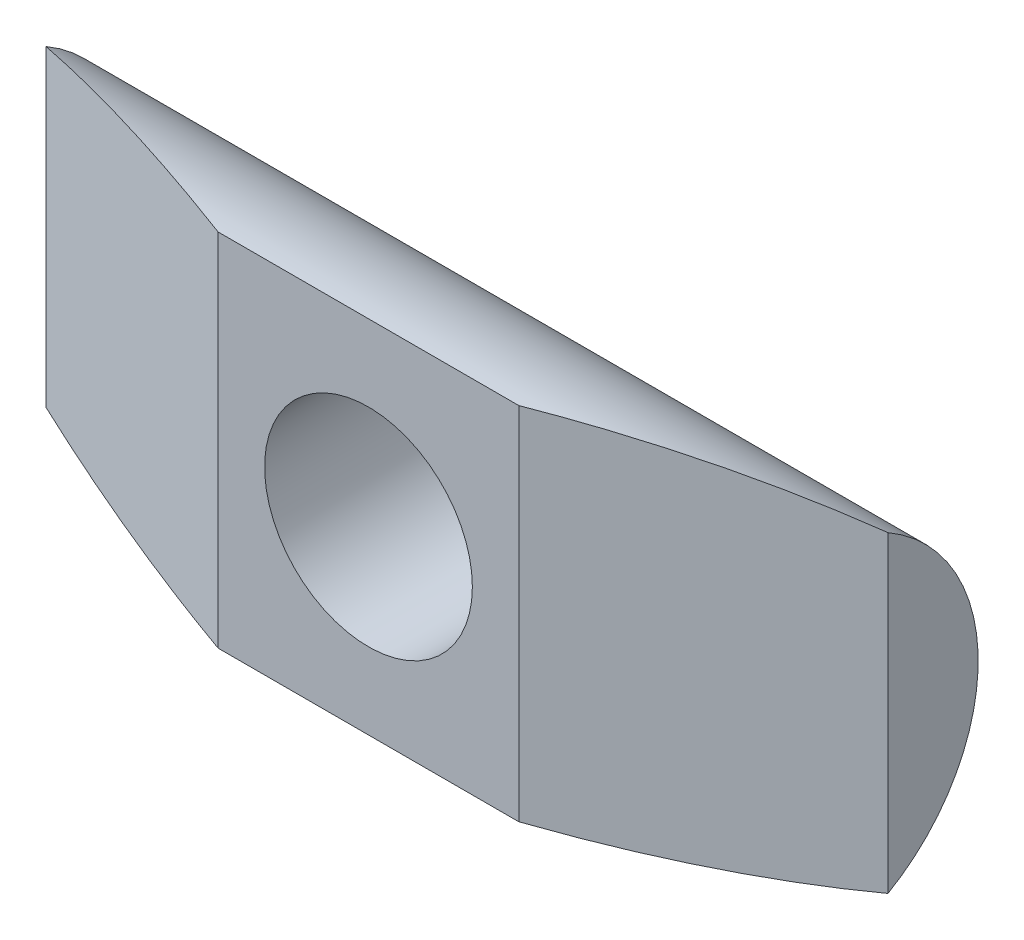
ISO-10303-21;
HEADER;
FILE_DESCRIPTION(('STEP AP214'),'2;1');
FILE_NAME('part.step','',(''),(''),'','','');
FILE_SCHEMA(('AUTOMOTIVE_DESIGN { 1 0 10303 214 1 1 1 1 }'));
ENDSEC;
DATA;
#1=APPLICATION_CONTEXT('core data for automotive mechanical design processes');
#2=APPLICATION_PROTOCOL_DEFINITION('international standard','automotive_design',2000,#1);
#3=PRODUCT_CONTEXT('',#1,'mechanical');
#4=PRODUCT('Part','Part','',(#3));
#5=PRODUCT_RELATED_PRODUCT_CATEGORY('part','',(#4));
#6=PRODUCT_DEFINITION_FORMATION('','',#4);
#7=PRODUCT_DEFINITION_CONTEXT('part definition',#1,'design');
#8=PRODUCT_DEFINITION('design','',#6,#7);
#9=PRODUCT_DEFINITION_SHAPE('','',#8);
#10=(LENGTH_UNIT() NAMED_UNIT(*) SI_UNIT(.MILLI.,.METRE.));
#11=(NAMED_UNIT(*) PLANE_ANGLE_UNIT() SI_UNIT($,.RADIAN.));
#12=(NAMED_UNIT(*) SI_UNIT($,.STERADIAN.) SOLID_ANGLE_UNIT());
#13=UNCERTAINTY_MEASURE_WITH_UNIT(LENGTH_MEASURE(1.E-05),#10,'distance_accuracy_value','');
#14=(GEOMETRIC_REPRESENTATION_CONTEXT(3) GLOBAL_UNCERTAINTY_ASSIGNED_CONTEXT((#13)) GLOBAL_UNIT_ASSIGNED_CONTEXT((#10,
#11,#12)) REPRESENTATION_CONTEXT('',''));
#15=CARTESIAN_POINT('',(0.,0.,0.));
#16=DIRECTION('',(0.,0.,1.));
#17=DIRECTION('',(1.,0.,0.));
#18=AXIS2_PLACEMENT_3D('',#15,#16,#17);
#19=CARTESIAN_POINT('',(-14.,0.,0.));
#20=DIRECTION('',(1.,0.,0.));
#21=DIRECTION('',(0.,0.,-1.));
#22=AXIS2_PLACEMENT_3D('',#19,#20,#21);
#23=CYLINDRICAL_SURFACE('',#22,6.);
#24=CARTESIAN_POINT('',(3.4544,0.,-6.));
#25=CARTESIAN_POINT('',(3.45439921898934,-0.0890025247768635,-5.99999928987297));
#26=CARTESIAN_POINT('',(3.45095478193103,-0.178029493212493,-5.998014397073));
#27=CARTESIAN_POINT('',(3.43722011436506,-0.355415955447675,-5.99012290458809));
#28=CARTESIAN_POINT('',(3.42692579023553,-0.443775018140048,-5.98421395981977));
#29=CARTESIAN_POINT('',(3.39959760043751,-0.619284647285888,-5.96860596572888));
#30=CARTESIAN_POINT('',(3.38255088748408,-0.70643258032686,-5.95889969193811));
#31=CARTESIAN_POINT('',(3.3419395504222,-0.878731702228658,-5.93594180401801));
#32=CARTESIAN_POINT('',(3.31837215082102,-0.963882024038264,-5.92268868027124));
#33=CARTESIAN_POINT('',(3.23855299598419,-1.21459488407285,-5.87821096315222));
#34=CARTESIAN_POINT('',(3.17301834607299,-1.3764599534809,-5.84216992524478));
#35=CARTESIAN_POINT('',(3.01976785833436,-1.6863682211323,-5.76037649899437));
#36=CARTESIAN_POINT('',(2.93205762380787,-1.8344148980717,-5.7146265643525));
#37=CARTESIAN_POINT('',(2.72976687812328,-2.12480394568095,-5.61342266116156));
#38=CARTESIAN_POINT('',(2.61369379881022,-2.26594397625408,-5.55750443409247));
#39=CARTESIAN_POINT('',(2.36128363756551,-2.52791846070738,-5.44335385435898));
#40=CARTESIAN_POINT('',(2.22492255770303,-2.6487285013681,-5.38511882181833));
#41=CARTESIAN_POINT('',(1.91795529474811,-2.88014922887508,-5.26531274081294));
#42=CARTESIAN_POINT('',(1.74522910671619,-2.98814940131263,-5.20408628966167));
#43=CARTESIAN_POINT('',(1.38050047664221,-3.17312745020671,-5.09342153215339));
#44=CARTESIAN_POINT('',(1.18852810920303,-3.25015281315714,-5.04396522924281));
#45=CARTESIAN_POINT('',(0.834815880396335,-3.35588729956328,-4.97404268116328));
#46=CARTESIAN_POINT('',(0.675952302025197,-3.39155837727163,-4.94956223304145));
#47=CARTESIAN_POINT('',(0.35325825412214,-3.440150282253,-4.91592086234216));
#48=CARTESIAN_POINT('',(0.189433431781938,-3.45309605490536,-4.90674314264228));
#49=CARTESIAN_POINT('',(-0.138712032594599,-3.45551776037083,-4.90503830395962));
#50=CARTESIAN_POINT('',(-0.303033049020929,-3.44495975133199,-4.91253526489832));
#51=CARTESIAN_POINT('',(-0.627121621278127,-3.40093900483978,-4.94310627559886));
#52=CARTESIAN_POINT('',(-0.786885917851981,-3.36746028080084,-4.96619119739217));
#53=CARTESIAN_POINT('',(-1.09712012878664,-3.27949684491801,-5.0247027285861));
#54=CARTESIAN_POINT('',(-1.2476331675814,-3.22511979627003,-5.06006599415033));
#55=CARTESIAN_POINT('',(-1.53785648665194,-3.09726621315077,-5.13931806397932));
#56=CARTESIAN_POINT('',(-1.67756263191518,-3.02378241435952,-5.18321010924923));
#57=CARTESIAN_POINT('',(-1.96631504361599,-2.84599776728001,-5.28320789487936));
#58=CARTESIAN_POINT('',(-2.11319054796475,-2.73862969226059,-5.34013936955619));
#59=CARTESIAN_POINT('',(-2.38824837719828,-2.502416496376,-5.45483330168754));
#60=CARTESIAN_POINT('',(-2.51641427462678,-2.37355271195356,-5.51259644106085));
#61=CARTESIAN_POINT('',(-2.76565722298808,-2.07972369661752,-5.63050054560709));
#62=CARTESIAN_POINT('',(-2.88413260924484,-1.91229579108908,-5.69012364322553));
#63=CARTESIAN_POINT('',(-3.03904449158945,-1.64551015958455,-5.77070137391051));
#64=CARTESIAN_POINT('',(-3.08689617988591,-1.55393450003539,-5.79609285904931));
#65=CARTESIAN_POINT('',(-3.1744859378761,-1.36610170509735,-5.8432107538657));
#66=CARTESIAN_POINT('',(-3.21422893281565,-1.26984745576158,-5.86493938696881));
#67=CARTESIAN_POINT('',(-3.28266329014318,-1.08003732865997,-5.90273186874885));
#68=CARTESIAN_POINT('',(-3.31192192607287,-0.986742185034364,-5.91908022599022));
#69=CARTESIAN_POINT('',(-3.36252228604426,-0.797441635699795,-5.94754052727591));
#70=CARTESIAN_POINT('',(-3.383868300688,-0.70143772929441,-5.9596547670573));
#71=CARTESIAN_POINT('',(-3.41832629049983,-0.507556147381272,-5.97928713892707));
#72=CARTESIAN_POINT('',(-3.43144314775871,-0.4096796184277,-5.98680799604934));
#73=CARTESIAN_POINT('',(-3.44924646261929,-0.212918105626553,-5.9970299565629));
#74=CARTESIAN_POINT('',(-3.45393389730074,-0.11403323999478,-5.99973161856132));
#75=CARTESIAN_POINT('',(-3.4547462520113,0.071533433504897,-6.00019937573239));
#76=CARTESIAN_POINT('',(-3.45185922042307,0.158210674539508,-5.99853500118922));
#77=CARTESIAN_POINT('',(-3.43960125393638,0.330962075486235,-5.99149043803351));
#78=CARTESIAN_POINT('',(-3.43022819348286,0.417036028349668,-5.98610903130277));
#79=CARTESIAN_POINT('',(-3.39252729125364,0.673323120597361,-5.96455311308873));
#80=CARTESIAN_POINT('',(-3.35461822597177,0.84179221927222,-5.94296699474927));
#81=CARTESIAN_POINT('',(-3.25564035906786,1.16718795601752,-5.88767121008537));
#82=CARTESIAN_POINT('',(-3.19485944907171,1.324230244709,-5.85411250659272));
#83=CARTESIAN_POINT('',(-3.05235401232043,1.6259971043955,-5.77757518673973));
#84=CARTESIAN_POINT('',(-2.97062459084375,1.77071878607877,-5.73459436919681));
#85=CARTESIAN_POINT('',(-2.77895959015346,2.05995970251254,-5.63757038835305));
#86=CARTESIAN_POINT('',(-2.66697210122832,2.20288591736509,-5.58284115804983));
#87=CARTESIAN_POINT('',(-2.42269640159962,2.46902932850767,-5.47035783853533));
#88=CARTESIAN_POINT('',(-2.29038479602086,2.5922234732863,-5.41260031460445));
#89=CARTESIAN_POINT('',(-1.99140539371982,2.82978906614515,-5.29263123108389));
#90=CARTESIAN_POINT('',(-1.82253871382815,2.94153760009073,-5.23066633381948));
#91=CARTESIAN_POINT('',(-1.46517905689068,3.13484533772696,-5.11716292030284));
#92=CARTESIAN_POINT('',(-1.27671195867649,3.21644371679014,-5.0656109139292));
#93=CARTESIAN_POINT('',(-0.926528642954367,3.33177773577451,-4.9902857451768));
#94=CARTESIAN_POINT('',(-0.767731928803084,3.37202227147148,-4.96292739598951));
#95=CARTESIAN_POINT('',(-0.444274053143748,3.42963628312249,-4.92329740475631));
#96=CARTESIAN_POINT('',(-0.279620023311164,3.44703266099302,-4.91100802131798));
#97=CARTESIAN_POINT('',(0.0512610299865741,3.45799230164151,-4.90329940784792));
#98=CARTESIAN_POINT('',(0.217490752097159,3.45150205350862,-4.90791805512812));
#99=CARTESIAN_POINT('',(0.546100458630568,3.41497054476564,-4.93340065829837));
#100=CARTESIAN_POINT('',(0.708477964463519,3.38491452338617,-4.95427479599876));
#101=CARTESIAN_POINT('',(1.02167834727667,3.30373911074967,-5.00875263378437));
#102=CARTESIAN_POINT('',(1.1726747289011,3.25308715633281,-5.04207258410152));
#103=CARTESIAN_POINT('',(1.46435430344148,3.13264657945839,-5.11777016410095));
#104=CARTESIAN_POINT('',(1.60503372255556,3.06285099834095,-5.16015108618588));
#105=CARTESIAN_POINT('',(1.89525486820885,2.89366460020851,-5.2571475396122));
#106=CARTESIAN_POINT('',(2.04280868081729,2.79136756896818,-5.31264169755519));
#107=CARTESIAN_POINT('',(2.32008862610775,2.56555735023689,-5.42529830404962));
#108=CARTESIAN_POINT('',(2.44979869054688,2.44202526288426,-5.48246220077244));
#109=CARTESIAN_POINT('',(2.7048577224615,2.15814561004922,-5.6008032286322));
#110=CARTESIAN_POINT('',(2.82743929347895,1.99509870111402,-5.66153362970224));
#111=CARTESIAN_POINT('',(3.04320321969928,1.64730078192699,-5.77231638159746));
#112=CARTESIAN_POINT('',(3.13640213687392,1.46256207946903,-5.8223747427065));
#113=CARTESIAN_POINT('',(3.27547485242939,1.1105182463965,-5.89856868878244));
#114=CARTESIAN_POINT('',(3.32682279952143,0.945974132980587,-5.92737785517799));
#115=CARTESIAN_POINT('',(3.38510261957639,0.693839701723605,-5.96035248934734));
#116=CARTESIAN_POINT('',(3.40139975194672,0.608981353510738,-5.96963403641377));
#117=CARTESIAN_POINT('',(3.42761015042143,0.437986272713973,-5.98460616581198));
#118=CARTESIAN_POINT('',(3.43752689208844,0.3518502623122,-5.99029870313554));
#119=CARTESIAN_POINT('',(3.44758955946569,0.221285263613514,-5.99608109085097));
#120=CARTESIAN_POINT('',(3.45014215417564,0.177085018827701,-5.99754946978157));
#121=CARTESIAN_POINT('',(3.45354767287192,0.0885918749760161,-5.9995091609027));
#122=CARTESIAN_POINT('',(3.45440038873014,0.0442989652290428,-6.00000035344944));
#123=CARTESIAN_POINT('',(3.4544,0.,-6.));
#124=B_SPLINE_CURVE_WITH_KNOTS('',3,(#24,#25,#26,#27,#28,#29,#30,#31,#32,#33,#34,#35,#36,#37,
#38,#39,#40,#41,#42,#43,#44,#45,#46,#47,#48,#49,#50,#51,#52,#53,#54,#55,#56,#57,#58,#59,#60,#61,
#62,#63,#64,#65,#66,#67,#68,#69,#70,#71,#72,#73,#74,#75,#76,#77,#78,#79,#80,#81,#82,#83,#84,#85,
#86,#87,#88,#89,#90,#91,#92,#93,#94,#95,#96,#97,#98,#99,#100,#101,#102,#103,#104,#105,#106,#107,
#108,#109,#110,#111,#112,#113,#114,#115,#116,#117,#118,#119,#120,#121,#122,#123),.UNSPECIFIED.,
.T.,.F.,(4,2,2,2,2,2,2,2,2,2,2,2,2,2,2,2,2,2,2,2,2,2,2,2,2,2,2,2,2,2,2,2,2,2,2,2,2,2,2,2,2,2,2,
2,2,2,2,2,2,4),(0.,0.266961307336892,0.534082299252971,0.801713983246575,1.06945975883829,
1.60181686219707,2.13403958438384,2.70505579276962,3.27675288570658,3.91175201744222,
4.54577390659703,5.03759364620741,5.5288731809774,6.02086263353241,6.51319558562288,
7.00302543793377,7.49304179485808,8.06267787950159,8.63281114740295,9.26992334820901,
9.58873496048437,9.90735234527295,10.2043300197065,10.5011464222402,10.7977865663455,
11.0943923237814,11.3542842688428,11.6142614241967,12.1336511334778,12.6467107481056,
13.1598903510606,13.7265532230052,14.2938733313732,14.9261149619433,15.557532181044,
16.0536722061697,16.5492275400179,17.0458936938584,17.54287119063,18.0291485331307,
18.5156028710088,19.0772015767001,19.6393027355213,20.2746002449324,20.9095390165134,
21.4313152017037,21.6917700671883,21.9520829358318,22.0849405374945,22.2178144048467),.UNSPECIFIED.);
#125=CARTESIAN_POINT('',(3.4544,0.,-6.));
#126=VERTEX_POINT('',#125);
#127=EDGE_CURVE('E11',#126,#126,#124,.T.);
#128=ORIENTED_EDGE('',*,*,#127,.F.);
#129=EDGE_LOOP('',(#128));
#130=FACE_BOUND('',#129,.T.);
#131=DIRECTION('',(1.,0.,0.));
#132=VECTOR('',#131,1.);
#133=CARTESIAN_POINT('',(-14.,-5.99366096842319,0.275732108395758));
#134=LINE('',#133,#132);
#135=CARTESIAN_POINT('',(5.,-5.99366096842319,0.275732108395758));
#136=VERTEX_POINT('',#135);
#137=CARTESIAN_POINT('',(-5.,-5.99366096842319,0.275732108395758));
#138=VERTEX_POINT('',#137);
#139=EDGE_CURVE('E49',#136,#138,#134,.F.);
#140=ORIENTED_EDGE('',*,*,#139,.T.);
#141=CARTESIAN_POINT('',(-5.75756774163597,0.,0.));
#142=DIRECTION('',(-0.342020143325663,0.,0.93969262078591));
#143=DIRECTION('',(0.939692620785911,0.,0.342020143325663));
#144=AXIS2_PLACEMENT_3D('',#141,#142,#143);
#145=ELLIPSE('',#144,17.5428264009788,6.);
#146=CARTESIAN_POINT('',(-14.,-5.19615242270666,-3.));
#147=VERTEX_POINT('',#146);
#148=EDGE_CURVE('E64',#138,#147,#145,.F.);
#149=ORIENTED_EDGE('',*,*,#148,.T.);
#150=CARTESIAN_POINT('',(-14.,0.,0.));
#151=DIRECTION('',(1.,0.,0.));
#152=DIRECTION('',(0.,0.,-1.));
#153=AXIS2_PLACEMENT_3D('',#150,#151,#152);
#154=CIRCLE('',#153,6.);
#155=CARTESIAN_POINT('',(-14.,5.19615242270666,-3.));
#156=VERTEX_POINT('',#155);
#157=EDGE_CURVE('E90',#147,#156,#154,.T.);
#158=ORIENTED_EDGE('',*,*,#157,.T.);
#159=CARTESIAN_POINT('',(-5.,5.99366096842319,0.275732108395758));
#160=VERTEX_POINT('',#159);
#161=EDGE_CURVE('E104',#156,#160,#145,.F.);
#162=ORIENTED_EDGE('',*,*,#161,.T.);
#163=DIRECTION('',(1.,0.,0.));
#164=VECTOR('',#163,1.);
#165=CARTESIAN_POINT('',(-14.,5.99366096842319,0.275732108395758));
#166=LINE('',#165,#164);
#167=CARTESIAN_POINT('',(5.,5.99366096842319,0.275732108395758));
#168=VERTEX_POINT('',#167);
#169=EDGE_CURVE('E97',#160,#168,#166,.T.);
#170=ORIENTED_EDGE('',*,*,#169,.T.);
#171=CARTESIAN_POINT('',(5.75756774163597,0.,0.));
#172=DIRECTION('',(0.342020143325662,0.,0.939692620785911));
#173=DIRECTION('',(0.939692620785911,0.,-0.342020143325662));
#174=AXIS2_PLACEMENT_3D('',#171,#172,#173);
#175=ELLIPSE('',#174,17.5428264009789,6.);
#176=CARTESIAN_POINT('',(14.,5.19615242270666,-3.));
#177=VERTEX_POINT('',#176);
#178=EDGE_CURVE('E84',#168,#177,#175,.F.);
#179=ORIENTED_EDGE('',*,*,#178,.T.);
#180=CARTESIAN_POINT('',(14.,0.,0.));
#181=DIRECTION('',(1.,0.,0.));
#182=DIRECTION('',(0.,0.,-1.));
#183=AXIS2_PLACEMENT_3D('',#180,#181,#182);
#184=CIRCLE('',#183,6.);
#185=CARTESIAN_POINT('',(14.,-5.19615242270666,-3.));
#186=VERTEX_POINT('',#185);
#187=EDGE_CURVE('E95',#186,#177,#184,.T.);
#188=ORIENTED_EDGE('',*,*,#187,.F.);
#189=EDGE_CURVE('E56',#186,#136,#175,.F.);
#190=ORIENTED_EDGE('',*,*,#189,.T.);
#191=EDGE_LOOP('',(#140,#149,#158,#162,#170,#179,#188,#190));
#192=FACE_BOUND('',#191,.T.);
#193=ADVANCED_FACE('F37',(#130,#192),#23,.T.);
#194=CARTESIAN_POINT('',(-14.,0.,0.));
#195=DIRECTION('',(1.,0.,0.));
#196=DIRECTION('',(0.,0.,-1.));
#197=AXIS2_PLACEMENT_3D('',#194,#195,#196);
#198=PLANE('',#197);
#199=DIRECTION('',(0.,-1.,0.));
#200=VECTOR('',#199,1.);
#201=CARTESIAN_POINT('',(-14.,0.,-3.));
#202=LINE('',#201,#200);
#203=EDGE_CURVE('E89',#156,#147,#202,.T.);
#204=ORIENTED_EDGE('',*,*,#203,.F.);
#205=ORIENTED_EDGE('',*,*,#157,.F.);
#206=EDGE_LOOP('',(#204,#205));
#207=FACE_BOUND('',#206,.T.);
#208=ADVANCED_FACE('F131',(#207),#198,.F.);
#209=CARTESIAN_POINT('',(14.,0.,0.));
#210=DIRECTION('',(1.,0.,0.));
#211=DIRECTION('',(0.,0.,-1.));
#212=AXIS2_PLACEMENT_3D('',#209,#210,#211);
#213=PLANE('',#212);
#214=ORIENTED_EDGE('',*,*,#187,.T.);
#215=DIRECTION('',(0.,-1.,0.));
#216=VECTOR('',#215,1.);
#217=CARTESIAN_POINT('',(14.,0.,-3.));
#218=LINE('',#217,#216);
#219=EDGE_CURVE('E81',#177,#186,#218,.T.);
#220=ORIENTED_EDGE('',*,*,#219,.T.);
#221=EDGE_LOOP('',(#214,#220));
#222=FACE_BOUND('',#221,.T.);
#223=ADVANCED_FACE('F100',(#222),#213,.T.);
#224=CARTESIAN_POINT('',(-5.,20.,0.275732108395758));
#225=DIRECTION('',(-0.342020143325663,0.,0.93969262078591));
#226=DIRECTION('',(0.939692620785911,0.,0.342020143325663));
#227=AXIS2_PLACEMENT_3D('',#224,#225,#226);
#228=PLANE('',#227);
#229=DIRECTION('',(0.,-1.,0.));
#230=VECTOR('',#229,1.);
#231=CARTESIAN_POINT('',(-5.,20.,0.275732108395758));
#232=LINE('',#231,#230);
#233=EDGE_CURVE('E111',#160,#138,#232,.T.);
#234=ORIENTED_EDGE('',*,*,#233,.F.);
#235=ORIENTED_EDGE('',*,*,#161,.F.);
#236=ORIENTED_EDGE('',*,*,#203,.T.);
#237=ORIENTED_EDGE('',*,*,#148,.F.);
#238=EDGE_LOOP('',(#234,#235,#236,#237));
#239=FACE_BOUND('',#238,.T.);
#240=ADVANCED_FACE('F128',(#239),#228,.T.);
#241=CARTESIAN_POINT('',(5.,20.,0.275732108395758));
#242=DIRECTION('',(0.342020143325662,0.,0.939692620785911));
#243=DIRECTION('',(0.939692620785911,0.,-0.342020143325662));
#244=AXIS2_PLACEMENT_3D('',#241,#242,#243);
#245=PLANE('',#244);
#246=ORIENTED_EDGE('',*,*,#219,.F.);
#247=ORIENTED_EDGE('',*,*,#178,.F.);
#248=DIRECTION('',(0.,-1.,0.));
#249=VECTOR('',#248,1.);
#250=CARTESIAN_POINT('',(5.,20.,0.275732108395758));
#251=LINE('',#250,#249);
#252=EDGE_CURVE('E98',#168,#136,#251,.T.);
#253=ORIENTED_EDGE('',*,*,#252,.T.);
#254=ORIENTED_EDGE('',*,*,#189,.F.);
#255=EDGE_LOOP('',(#246,#247,#253,#254));
#256=FACE_BOUND('',#255,.T.);
#257=ADVANCED_FACE('F83',(#256),#245,.T.);
#258=CARTESIAN_POINT('',(-5.,20.,0.275732108395758));
#259=DIRECTION('',(0.,0.,1.));
#260=DIRECTION('',(1.,0.,0.));
#261=AXIS2_PLACEMENT_3D('',#258,#259,#260);
#262=PLANE('',#261);
#263=CARTESIAN_POINT('',(0.,0.,0.275732108395758));
#264=DIRECTION('',(0.,0.,1.));
#265=DIRECTION('',(1.,0.,0.));
#266=AXIS2_PLACEMENT_3D('',#263,#264,#265);
#267=CIRCLE('',#266,3.45439999999999);
#268=CARTESIAN_POINT('',(3.45439999999999,0.,0.275732108395758));
#269=VERTEX_POINT('',#268);
#270=EDGE_CURVE('E113',#269,#269,#267,.T.);
#271=ORIENTED_EDGE('',*,*,#270,.F.);
#272=EDGE_LOOP('',(#271));
#273=FACE_BOUND('',#272,.T.);
#274=ORIENTED_EDGE('',*,*,#252,.F.);
#275=ORIENTED_EDGE('',*,*,#169,.F.);
#276=ORIENTED_EDGE('',*,*,#233,.T.);
#277=ORIENTED_EDGE('',*,*,#139,.F.);
#278=EDGE_LOOP('',(#274,#275,#276,#277));
#279=FACE_BOUND('',#278,.T.);
#280=ADVANCED_FACE('F110',(#273,#279),#262,.T.);
#281=CARTESIAN_POINT('',(0.,0.,0.275732108395758));
#282=DIRECTION('',(0.,0.,1.));
#283=DIRECTION('',(1.,0.,0.));
#284=AXIS2_PLACEMENT_3D('',#281,#282,#283);
#285=CYLINDRICAL_SURFACE('',#284,3.45439999999999);
#286=ORIENTED_EDGE('',*,*,#127,.T.);
#287=EDGE_LOOP('',(#286));
#288=FACE_BOUND('',#287,.T.);
#289=ORIENTED_EDGE('',*,*,#270,.T.);
#290=EDGE_LOOP('',(#289));
#291=FACE_BOUND('',#290,.T.);
#292=ADVANCED_FACE('F119',(#288,#291),#285,.F.);
#293=CLOSED_SHELL('',(#193,#208,#223,#240,#257,#280,#292));
#294=MANIFOLD_SOLID_BREP('B2',#293);
#295=ADVANCED_BREP_SHAPE_REPRESENTATION('',(#18,#294),#14);
#296=SHAPE_DEFINITION_REPRESENTATION(#9,#295);
ENDSEC;
END-ISO-10303-21;
